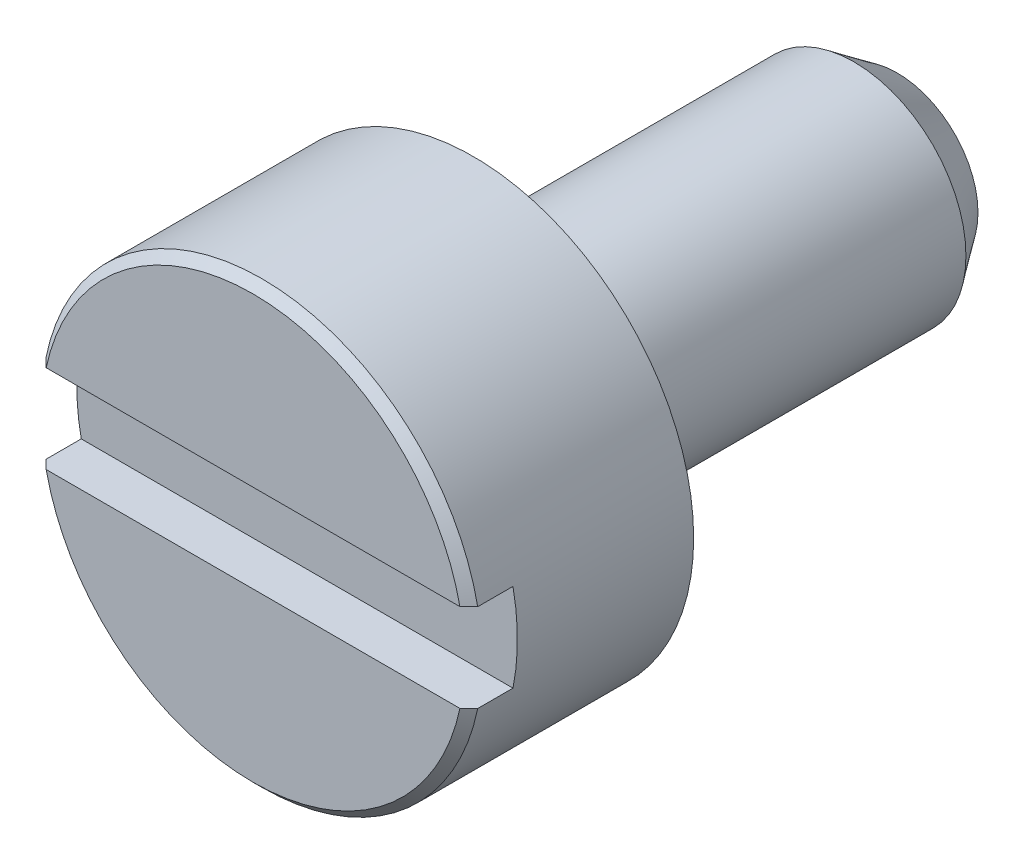
ISO-10303-21;
HEADER;
FILE_DESCRIPTION(('STEP AP214'),'2;1');
FILE_NAME('part.step','',(''),(''),'','','');
FILE_SCHEMA(('AUTOMOTIVE_DESIGN { 1 0 10303 214 1 1 1 1 }'));
ENDSEC;
DATA;
#1=APPLICATION_CONTEXT('core data for automotive mechanical design processes');
#2=APPLICATION_PROTOCOL_DEFINITION('international standard','automotive_design',2000,#1);
#3=PRODUCT_CONTEXT('',#1,'mechanical');
#4=PRODUCT('Part','Part','',(#3));
#5=PRODUCT_RELATED_PRODUCT_CATEGORY('part','',(#4));
#6=PRODUCT_DEFINITION_FORMATION('','',#4);
#7=PRODUCT_DEFINITION_CONTEXT('part definition',#1,'design');
#8=PRODUCT_DEFINITION('design','',#6,#7);
#9=PRODUCT_DEFINITION_SHAPE('','',#8);
#10=(LENGTH_UNIT() NAMED_UNIT(*) SI_UNIT(.MILLI.,.METRE.));
#11=(NAMED_UNIT(*) PLANE_ANGLE_UNIT() SI_UNIT($,.RADIAN.));
#12=(NAMED_UNIT(*) SI_UNIT($,.STERADIAN.) SOLID_ANGLE_UNIT());
#13=UNCERTAINTY_MEASURE_WITH_UNIT(LENGTH_MEASURE(1.E-05),#10,'distance_accuracy_value','');
#14=(GEOMETRIC_REPRESENTATION_CONTEXT(3) GLOBAL_UNCERTAINTY_ASSIGNED_CONTEXT((#13)) GLOBAL_UNIT_ASSIGNED_CONTEXT((#10,
#11,#12)) REPRESENTATION_CONTEXT('',''));
#15=CARTESIAN_POINT('',(0.,0.,0.));
#16=DIRECTION('',(0.,0.,1.));
#17=DIRECTION('',(1.,0.,0.));
#18=AXIS2_PLACEMENT_3D('',#15,#16,#17);
#19=CARTESIAN_POINT('',(62.86763763428,13.8324710840975,12.9742437304326));
#20=DIRECTION('',(0.,0.,-1.));
#21=DIRECTION('',(-1.,0.,0.));
#22=AXIS2_PLACEMENT_3D('',#19,#20,#21);
#23=PLANE('',#22);
#24=CARTESIAN_POINT('',(62.86763763428,13.8324710840975,12.9742437304326));
#25=DIRECTION('',(0.,0.,-1.));
#26=DIRECTION('',(-1.,0.,0.));
#27=AXIS2_PLACEMENT_3D('',#24,#25,#26);
#28=CIRCLE('',#27,1.22);
#29=CARTESIAN_POINT('',(61.6722866683457,13.5884710840975,12.9742437304326));
#30=VERTEX_POINT('',#29);
#31=CARTESIAN_POINT('',(61.6722866398014,14.0764710840975,12.9742437304326));
#32=VERTEX_POINT('',#31);
#33=EDGE_CURVE('E98',#30,#32,#28,.T.);
#34=ORIENTED_EDGE('',*,*,#33,.F.);
#35=DIRECTION('',(1.,0.,0.));
#36=VECTOR('',#35,1.);
#37=CARTESIAN_POINT('',(62.86763763428,13.5884710840975,12.9742437304326));
#38=LINE('',#37,#36);
#39=CARTESIAN_POINT('',(64.0629886287574,13.5884710840975,12.9742437304326));
#40=VERTEX_POINT('',#39);
#41=EDGE_CURVE('E100',#30,#40,#38,.T.);
#42=ORIENTED_EDGE('',*,*,#41,.T.);
#43=CARTESIAN_POINT('',(62.86763763428,13.8324710840975,12.9742437304326));
#44=DIRECTION('',(0.,0.,-1.));
#45=DIRECTION('',(-1.,0.,0.));
#46=AXIS2_PLACEMENT_3D('',#43,#44,#45);
#47=CIRCLE('',#46,1.22);
#48=CARTESIAN_POINT('',(64.0629886002143,14.0764710840975,12.9742437304326));
#49=VERTEX_POINT('',#48);
#50=EDGE_CURVE('E40',#49,#40,#47,.T.);
#51=ORIENTED_EDGE('',*,*,#50,.F.);
#52=DIRECTION('',(1.,0.,0.));
#53=VECTOR('',#52,1.);
#54=CARTESIAN_POINT('',(62.86763763428,14.0764710840975,12.9742437304326));
#55=LINE('',#54,#53);
#56=EDGE_CURVE('E206',#49,#32,#55,.F.);
#57=ORIENTED_EDGE('',*,*,#56,.T.);
#58=EDGE_LOOP('',(#34,#42,#51,#57));
#59=FACE_BOUND('',#58,.T.);
#60=ADVANCED_FACE('F37',(#59),#23,.F.);
#61=CARTESIAN_POINT('',(63.091040413381,13.8324710840975,9.65053280437672));
#62=DIRECTION('',(0.,0.,-1.));
#63=DIRECTION('',(-1.,0.,0.));
#64=AXIS2_PLACEMENT_3D('',#61,#62,#63);
#65=PLANE('',#64);
#66=CARTESIAN_POINT('',(62.86763763428,13.8324710840975,9.65053280437748));
#67=DIRECTION('',(0.,0.,1.));
#68=DIRECTION('',(1.,0.,0.));
#69=AXIS2_PLACEMENT_3D('',#66,#67,#68);
#70=CIRCLE('',#69,0.446805558209882);
#71=CARTESIAN_POINT('',(63.3144431924899,13.8324710840975,9.65053280437748));
#72=VERTEX_POINT('',#71);
#73=EDGE_CURVE('E131',#72,#72,#70,.T.);
#74=ORIENTED_EDGE('',*,*,#73,.F.);
#75=EDGE_LOOP('',(#74));
#76=FACE_BOUND('',#75,.T.);
#77=ADVANCED_FACE('F175',(#76),#65,.T.);
#78=CARTESIAN_POINT('',(62.86763763428,13.5884710840975,12.9742437304326));
#79=DIRECTION('',(0.,-1.,0.));
#80=DIRECTION('',(0.,0.,-1.));
#81=AXIS2_PLACEMENT_3D('',#78,#79,#80);
#82=PLANE('',#81);
#83=ORIENTED_EDGE('',*,*,#41,.F.);
#84=DIRECTION('',(0.,0.,-1.));
#85=VECTOR('',#84,1.);
#86=CARTESIAN_POINT('',(61.6722866968896,13.5884710840975,12.9742437304326));
#87=LINE('',#86,#85);
#88=CARTESIAN_POINT('',(61.6722862270357,13.5884711366204,13.169442908681));
#89=VERTEX_POINT('',#88);
#90=EDGE_CURVE('E104',#89,#30,#87,.T.);
#91=ORIENTED_EDGE('',*,*,#90,.F.);
#92=CARTESIAN_POINT('',(61.7221362418796,13.5884710840975,13.21824373043));
#93=CARTESIAN_POINT('',(61.7138241389333,13.5884710840975,13.2101138590567));
#94=CARTESIAN_POINT('',(61.7055138399089,13.5884710840975,13.2019821449625));
#95=CARTESIAN_POINT('',(61.6888968497204,13.5884710840975,13.1857150313483));
#96=CARTESIAN_POINT('',(61.6805901585563,13.5884710840975,13.1775796318284));
#97=CARTESIAN_POINT('',(61.672285271314,13.5884710840975,13.1694423895876));
#98=B_SPLINE_CURVE_WITH_KNOTS('',3,(#92,#93,#94,#95,#96,#97),.UNSPECIFIED.,.F.,.F.,(4,2,4),(0.,
0.034880834219915,0.0697616683697982),.UNSPECIFIED.);
#99=CARTESIAN_POINT('',(61.7221362418804,13.5884710840975,13.2182437304308));
#100=VERTEX_POINT('',#99);
#101=EDGE_CURVE('E116',#100,#89,#98,.T.);
#102=ORIENTED_EDGE('',*,*,#101,.F.);
#103=DIRECTION('',(1.,0.,0.));
#104=VECTOR('',#103,1.);
#105=CARTESIAN_POINT('',(63.47763763428,13.5884710840975,13.2182437304326));
#106=LINE('',#105,#104);
#107=CARTESIAN_POINT('',(64.0131390266796,13.5884710840975,13.2182437304308));
#108=VERTEX_POINT('',#107);
#109=EDGE_CURVE('E134',#108,#100,#106,.F.);
#110=ORIENTED_EDGE('',*,*,#109,.F.);
#111=CARTESIAN_POINT('',(64.0629897969934,13.588471477189,13.1694421084972));
#112=CARTESIAN_POINT('',(64.0546850226392,13.5884712806433,13.1775794787899));
#113=CARTESIAN_POINT('',(64.0463784046023,13.5884711496128,13.1857149657645));
#114=CARTESIAN_POINT('',(64.0297614811646,13.5884710185823,13.2019821730754));
#115=CARTESIAN_POINT('',(64.0214511757639,13.5884710185823,13.2101138934118));
#116=CARTESIAN_POINT('',(64.0131390266804,13.5884710840975,13.21824373043));
#117=B_SPLINE_CURVE_WITH_KNOTS('',3,(#111,#112,#113,#114,#115,#116),.UNSPECIFIED.,.F.,.F.,(4,2,
4),(0.,0.03488086099679,0.0697617219858891),.UNSPECIFIED.);
#118=CARTESIAN_POINT('',(64.0629886287577,13.5884710840975,13.1694428747936));
#119=VERTEX_POINT('',#118);
#120=EDGE_CURVE('E109',#119,#108,#117,.T.);
#121=ORIENTED_EDGE('',*,*,#120,.F.);
#122=DIRECTION('',(0.,0.,-1.));
#123=VECTOR('',#122,1.);
#124=CARTESIAN_POINT('',(64.0629886287566,13.5884710840975,12.9742437304326));
#125=LINE('',#124,#123);
#126=EDGE_CURVE('E91',#40,#119,#125,.F.);
#127=ORIENTED_EDGE('',*,*,#126,.F.);
#128=EDGE_LOOP('',(#83,#91,#102,#110,#121,#127));
#129=FACE_BOUND('',#128,.T.);
#130=ADVANCED_FACE('F107',(#129),#82,.F.);
#131=CARTESIAN_POINT('',(62.86763763428,14.0764710840975,12.9742437304326));
#132=DIRECTION('',(0.,1.,0.));
#133=DIRECTION('',(0.,0.,1.));
#134=AXIS2_PLACEMENT_3D('',#131,#132,#133);
#135=PLANE('',#134);
#136=ORIENTED_EDGE('',*,*,#56,.F.);
#137=DIRECTION('',(0.,0.,1.));
#138=VECTOR('',#137,1.);
#139=CARTESIAN_POINT('',(64.0629885716704,14.0764710840975,12.9742437304326));
#140=LINE('',#139,#138);
#141=CARTESIAN_POINT('',(64.0629890415243,14.0764710315746,13.169442908681));
#142=VERTEX_POINT('',#141);
#143=EDGE_CURVE('E94',#142,#49,#140,.F.);
#144=ORIENTED_EDGE('',*,*,#143,.F.);
#145=CARTESIAN_POINT('',(64.0131390266804,14.0764710840975,13.21824373043));
#146=CARTESIAN_POINT('',(64.0214511296267,14.0764710840975,13.2101138590567));
#147=CARTESIAN_POINT('',(64.0297614286511,14.0764710840975,13.2019821449625));
#148=CARTESIAN_POINT('',(64.0463784188397,14.0764710840975,13.1857150313483));
#149=CARTESIAN_POINT('',(64.0546851100037,14.0764710840975,13.1775796318284));
#150=CARTESIAN_POINT('',(64.062989997246,14.0764710840975,13.1694423895876));
#151=B_SPLINE_CURVE_WITH_KNOTS('',3,(#145,#146,#147,#148,#149,#150),.UNSPECIFIED.,.F.,.F.,(4,2,
4),(0.,0.0348808342199309,0.0697616683698093),.UNSPECIFIED.);
#152=CARTESIAN_POINT('',(64.0131390266796,14.0764710840975,13.2182437304308));
#153=VERTEX_POINT('',#152);
#154=EDGE_CURVE('E55',#153,#142,#151,.T.);
#155=ORIENTED_EDGE('',*,*,#154,.F.);
#156=DIRECTION('',(1.,0.,0.));
#157=VECTOR('',#156,1.);
#158=CARTESIAN_POINT('',(63.47763763428,14.0764710840975,13.2182437304326));
#159=LINE('',#158,#157);
#160=CARTESIAN_POINT('',(61.7221362418804,14.0764710840975,13.2182437304308));
#161=VERTEX_POINT('',#160);
#162=EDGE_CURVE('E201',#161,#153,#159,.T.);
#163=ORIENTED_EDGE('',*,*,#162,.F.);
#164=CARTESIAN_POINT('',(61.6722854715652,14.076470691006,13.1694421084957));
#165=CARTESIAN_POINT('',(61.6805902459196,14.0764708875518,13.1775794787887));
#166=CARTESIAN_POINT('',(61.6888968639568,14.0764710185823,13.1857149657635));
#167=CARTESIAN_POINT('',(61.7055137873949,14.0764711496128,13.201982173075));
#168=CARTESIAN_POINT('',(61.7138240927958,14.0764711496128,13.2101138934116));
#169=CARTESIAN_POINT('',(61.7221362418796,14.0764710840975,13.21824373043));
#170=B_SPLINE_CURVE_WITH_KNOTS('',3,(#164,#165,#166,#167,#168,#169),.UNSPECIFIED.,.F.,.F.,(4,2,
4),(0.,0.0348808609977919,0.0697617219878969),.UNSPECIFIED.);
#171=CARTESIAN_POINT('',(61.6722866398015,14.0764710840975,13.1694428747929));
#172=VERTEX_POINT('',#171);
#173=EDGE_CURVE('E110',#172,#161,#170,.T.);
#174=ORIENTED_EDGE('',*,*,#173,.F.);
#175=DIRECTION('',(0.,0.,1.));
#176=VECTOR('',#175,1.);
#177=CARTESIAN_POINT('',(61.6722866398009,14.0764710840975,12.9742437304326));
#178=LINE('',#177,#176);
#179=EDGE_CURVE('E135',#32,#172,#178,.T.);
#180=ORIENTED_EDGE('',*,*,#179,.F.);
#181=EDGE_LOOP('',(#136,#144,#155,#163,#174,#180));
#182=FACE_BOUND('',#181,.T.);
#183=ADVANCED_FACE('F145',(#182),#135,.F.);
#184=CARTESIAN_POINT('',(62.86763763428,13.8324710840975,9.89014391505863));
#185=DIRECTION('',(0.,0.,1.));
#186=DIRECTION('',(1.,0.,0.));
#187=AXIS2_PLACEMENT_3D('',#184,#185,#186);
#188=CONICAL_SURFACE('',#187,0.619602687837152,0.624784346431312);
#189=CARTESIAN_POINT('',(62.86763763428,13.8324710840975,9.89014391506391));
#190=DIRECTION('',(0.,0.,-1.));
#191=DIRECTION('',(-1.,0.,0.));
#192=AXIS2_PLACEMENT_3D('',#189,#190,#191);
#193=CIRCLE('',#192,0.61960268783566);
#194=CARTESIAN_POINT('',(62.2480349464443,13.8324710840975,9.89014391506391));
#195=VERTEX_POINT('',#194);
#196=EDGE_CURVE('E130',#195,#195,#193,.F.);
#197=ORIENTED_EDGE('',*,*,#196,.F.);
#198=EDGE_LOOP('',(#197));
#199=FACE_BOUND('',#198,.T.);
#200=ORIENTED_EDGE('',*,*,#73,.T.);
#201=EDGE_LOOP('',(#200));
#202=FACE_BOUND('',#201,.T.);
#203=ADVANCED_FACE('F217',(#199,#202),#188,.T.);
#204=CARTESIAN_POINT('',(63.47763763428,13.8324710840975,13.2182437304326));
#205=DIRECTION('',(0.,0.,1.));
#206=DIRECTION('',(1.,0.,0.));
#207=AXIS2_PLACEMENT_3D('',#204,#205,#206);
#208=PLANE('',#207);
#209=ORIENTED_EDGE('',*,*,#109,.T.);
#210=CARTESIAN_POINT('',(62.86763763428,13.8324710840975,13.2182437304316));
#211=DIRECTION('',(0.,0.,-1.));
#212=DIRECTION('',(-1.,0.,0.));
#213=AXIS2_PLACEMENT_3D('',#210,#211,#212);
#214=CIRCLE('',#213,1.17119999999473);
#215=EDGE_CURVE('E127',#108,#100,#214,.T.);
#216=ORIENTED_EDGE('',*,*,#215,.F.);
#217=EDGE_LOOP('',(#209,#216));
#218=FACE_BOUND('',#217,.T.);
#219=ADVANCED_FACE('F213',(#218),#208,.T.);
#220=CARTESIAN_POINT('',(63.47763763428,13.8324710840975,13.2182437304326));
#221=DIRECTION('',(0.,0.,1.));
#222=DIRECTION('',(1.,0.,0.));
#223=AXIS2_PLACEMENT_3D('',#220,#221,#222);
#224=PLANE('',#223);
#225=ORIENTED_EDGE('',*,*,#162,.T.);
#226=CARTESIAN_POINT('',(62.86763763428,13.8324710840975,13.2182437304316));
#227=DIRECTION('',(0.,0.,-1.));
#228=DIRECTION('',(-1.,0.,0.));
#229=AXIS2_PLACEMENT_3D('',#226,#227,#228);
#230=CIRCLE('',#229,1.17119999999473);
#231=EDGE_CURVE('E124',#161,#153,#230,.T.);
#232=ORIENTED_EDGE('',*,*,#231,.F.);
#233=EDGE_LOOP('',(#225,#232));
#234=FACE_BOUND('',#233,.T.);
#235=ADVANCED_FACE('F197',(#234),#224,.T.);
#236=CARTESIAN_POINT('',(62.86763763428,13.8324710840975,10.9441938227484));
#237=DIRECTION('',(0.,0.,-1.));
#238=DIRECTION('',(-1.,0.,0.));
#239=AXIS2_PLACEMENT_3D('',#236,#237,#238);
#240=CYLINDRICAL_SURFACE('',#239,0.61960268783566);
#241=CARTESIAN_POINT('',(62.86763763428,13.8324710840975,11.9982437304326));
#242=DIRECTION('',(0.,0.,-1.));
#243=DIRECTION('',(-1.,0.,0.));
#244=AXIS2_PLACEMENT_3D('',#241,#242,#243);
#245=CIRCLE('',#244,0.61960268783566);
#246=CARTESIAN_POINT('',(62.2480349464443,13.8324710840975,11.9982437304326));
#247=VERTEX_POINT('',#246);
#248=EDGE_CURVE('E121',#247,#247,#245,.F.);
#249=ORIENTED_EDGE('',*,*,#248,.F.);
#250=EDGE_LOOP('',(#249));
#251=FACE_BOUND('',#250,.T.);
#252=ORIENTED_EDGE('',*,*,#196,.T.);
#253=EDGE_LOOP('',(#252));
#254=FACE_BOUND('',#253,.T.);
#255=ADVANCED_FACE('F162',(#251,#254),#240,.T.);
#256=CARTESIAN_POINT('',(62.86763763428,13.8324710840975,13.1694423322993));
#257=DIRECTION('',(0.,0.,-1.));
#258=DIRECTION('',(-1.,0.,0.));
#259=AXIS2_PLACEMENT_3D('',#256,#257,#258);
#260=CONICAL_SURFACE('',#259,1.22000139812709,0.785398163397448);
#261=ORIENTED_EDGE('',*,*,#215,.T.);
#262=ORIENTED_EDGE('',*,*,#101,.T.);
#263=CARTESIAN_POINT('',(62.86763763428,13.8324710840975,13.1694437304263));
#264=DIRECTION('',(0.,0.,-1.));
#265=DIRECTION('',(-1.,0.,0.));
#266=AXIS2_PLACEMENT_3D('',#263,#264,#265);
#267=CIRCLE('',#266,1.22);
#268=EDGE_CURVE('E119',#119,#89,#267,.T.);
#269=ORIENTED_EDGE('',*,*,#268,.F.);
#270=ORIENTED_EDGE('',*,*,#120,.T.);
#271=EDGE_LOOP('',(#261,#262,#269,#270));
#272=FACE_BOUND('',#271,.T.);
#273=ADVANCED_FACE('F155',(#272),#260,.T.);
#274=CARTESIAN_POINT('',(62.86763763428,13.8324710840975,13.1694423322993));
#275=DIRECTION('',(0.,0.,-1.));
#276=DIRECTION('',(-1.,0.,0.));
#277=AXIS2_PLACEMENT_3D('',#274,#275,#276);
#278=CONICAL_SURFACE('',#277,1.22000139812709,0.785398163397448);
#279=ORIENTED_EDGE('',*,*,#231,.T.);
#280=ORIENTED_EDGE('',*,*,#154,.T.);
#281=CARTESIAN_POINT('',(62.86763763428,13.8324710840975,13.1694437304263));
#282=DIRECTION('',(0.,0.,-1.));
#283=DIRECTION('',(-1.,0.,0.));
#284=AXIS2_PLACEMENT_3D('',#281,#282,#283);
#285=CIRCLE('',#284,1.22);
#286=EDGE_CURVE('E46',#172,#142,#285,.T.);
#287=ORIENTED_EDGE('',*,*,#286,.F.);
#288=ORIENTED_EDGE('',*,*,#173,.T.);
#289=EDGE_LOOP('',(#279,#280,#287,#288));
#290=FACE_BOUND('',#289,.T.);
#291=ADVANCED_FACE('F149',(#290),#278,.T.);
#292=CARTESIAN_POINT('',(63.7874389781984,13.8324710840975,11.9982437304326));
#293=DIRECTION('',(0.,0.,-1.));
#294=DIRECTION('',(-1.,0.,0.));
#295=AXIS2_PLACEMENT_3D('',#292,#293,#294);
#296=PLANE('',#295);
#297=ORIENTED_EDGE('',*,*,#248,.T.);
#298=EDGE_LOOP('',(#297));
#299=FACE_BOUND('',#298,.T.);
#300=CARTESIAN_POINT('',(62.86763763428,13.8324710840975,11.9982437304326));
#301=DIRECTION('',(0.,0.,-1.));
#302=DIRECTION('',(-1.,0.,0.));
#303=AXIS2_PLACEMENT_3D('',#300,#301,#302);
#304=CIRCLE('',#303,1.22);
#305=CARTESIAN_POINT('',(61.64763763428,13.8324710840975,11.9982437304326));
#306=VERTEX_POINT('',#305);
#307=EDGE_CURVE('E11',#306,#306,#304,.F.);
#308=ORIENTED_EDGE('',*,*,#307,.F.);
#309=EDGE_LOOP('',(#308));
#310=FACE_BOUND('',#309,.T.);
#311=ADVANCED_FACE('F154',(#299,#310),#296,.T.);
#312=CARTESIAN_POINT('',(62.86763763428,13.8324710840975,12.6082437304326));
#313=DIRECTION('',(0.,0.,-1.));
#314=DIRECTION('',(-1.,0.,0.));
#315=AXIS2_PLACEMENT_3D('',#312,#313,#314);
#316=CYLINDRICAL_SURFACE('',#315,1.22);
#317=ORIENTED_EDGE('',*,*,#307,.T.);
#318=EDGE_LOOP('',(#317));
#319=FACE_BOUND('',#318,.T.);
#320=ORIENTED_EDGE('',*,*,#143,.T.);
#321=ORIENTED_EDGE('',*,*,#50,.T.);
#322=ORIENTED_EDGE('',*,*,#126,.T.);
#323=ORIENTED_EDGE('',*,*,#268,.T.);
#324=ORIENTED_EDGE('',*,*,#90,.T.);
#325=ORIENTED_EDGE('',*,*,#33,.T.);
#326=ORIENTED_EDGE('',*,*,#179,.T.);
#327=ORIENTED_EDGE('',*,*,#286,.T.);
#328=EDGE_LOOP('',(#320,#321,#322,#323,#324,#325,#326,#327));
#329=FACE_BOUND('',#328,.T.);
#330=ADVANCED_FACE('F88',(#319,#329),#316,.T.);
#331=CLOSED_SHELL('',(#60,#77,#130,#183,#203,#219,#235,#255,#273,#291,#311,#330));
#332=MANIFOLD_SOLID_BREP('B2',#331);
#333=ADVANCED_BREP_SHAPE_REPRESENTATION('',(#18,#332),#14);
#334=SHAPE_DEFINITION_REPRESENTATION(#9,#333);
ENDSEC;
END-ISO-10303-21;
